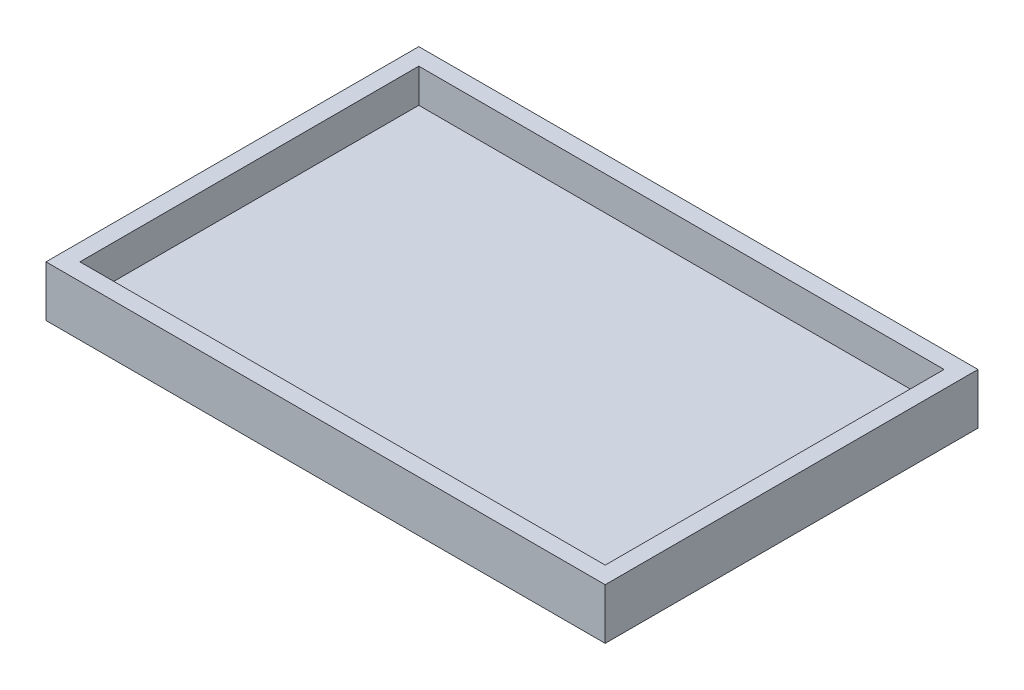
ISO-10303-21;
HEADER;
FILE_DESCRIPTION(('STEP AP214'),'2;1');
FILE_NAME('part.step','',(''),(''),'','','');
FILE_SCHEMA(('AUTOMOTIVE_DESIGN { 1 0 10303 214 1 1 1 1 }'));
ENDSEC;
DATA;
#1=APPLICATION_CONTEXT('core data for automotive mechanical design processes');
#2=APPLICATION_PROTOCOL_DEFINITION('international standard','automotive_design',2000,#1);
#3=PRODUCT_CONTEXT('',#1,'mechanical');
#4=PRODUCT('Part','Part','',(#3));
#5=PRODUCT_RELATED_PRODUCT_CATEGORY('part','',(#4));
#6=PRODUCT_DEFINITION_FORMATION('','',#4);
#7=PRODUCT_DEFINITION_CONTEXT('part definition',#1,'design');
#8=PRODUCT_DEFINITION('design','',#6,#7);
#9=PRODUCT_DEFINITION_SHAPE('','',#8);
#10=(LENGTH_UNIT() NAMED_UNIT(*) SI_UNIT(.MILLI.,.METRE.));
#11=(NAMED_UNIT(*) PLANE_ANGLE_UNIT() SI_UNIT($,.RADIAN.));
#12=(NAMED_UNIT(*) SI_UNIT($,.STERADIAN.) SOLID_ANGLE_UNIT());
#13=UNCERTAINTY_MEASURE_WITH_UNIT(LENGTH_MEASURE(1.E-05),#10,'distance_accuracy_value','');
#14=(GEOMETRIC_REPRESENTATION_CONTEXT(3) GLOBAL_UNCERTAINTY_ASSIGNED_CONTEXT((#13)) GLOBAL_UNIT_ASSIGNED_CONTEXT((#10,
#11,#12)) REPRESENTATION_CONTEXT('',''));
#15=CARTESIAN_POINT('',(0.,0.,0.));
#16=DIRECTION('',(0.,0.,1.));
#17=DIRECTION('',(1.,0.,0.));
#18=AXIS2_PLACEMENT_3D('',#15,#16,#17);
#19=CARTESIAN_POINT('',(0.,6.,-44.));
#20=DIRECTION('',(1.,0.,0.));
#21=DIRECTION('',(0.,0.,-1.));
#22=AXIS2_PLACEMENT_3D('',#19,#20,#21);
#23=PLANE('',#22);
#24=DIRECTION('',(0.,0.,1.));
#25=VECTOR('',#24,1.);
#26=CARTESIAN_POINT('',(0.,0.,-44.));
#27=LINE('',#26,#25);
#28=CARTESIAN_POINT('',(0.,0.,-44.));
#29=VERTEX_POINT('',#28);
#30=CARTESIAN_POINT('',(0.,0.,0.));
#31=VERTEX_POINT('',#30);
#32=EDGE_CURVE('E143',#29,#31,#27,.T.);
#33=ORIENTED_EDGE('',*,*,#32,.T.);
#34=DIRECTION('',(0.,-1.,0.));
#35=VECTOR('',#34,1.);
#36=CARTESIAN_POINT('',(0.,6.,0.));
#37=LINE('',#36,#35);
#38=CARTESIAN_POINT('',(0.,6.,0.));
#39=VERTEX_POINT('',#38);
#40=EDGE_CURVE('E11',#39,#31,#37,.T.);
#41=ORIENTED_EDGE('',*,*,#40,.F.);
#42=DIRECTION('',(0.,0.,1.));
#43=VECTOR('',#42,1.);
#44=CARTESIAN_POINT('',(0.,6.,-44.));
#45=LINE('',#44,#43);
#46=CARTESIAN_POINT('',(0.,6.,-44.));
#47=VERTEX_POINT('',#46);
#48=EDGE_CURVE('E147',#47,#39,#45,.T.);
#49=ORIENTED_EDGE('',*,*,#48,.F.);
#50=DIRECTION('',(0.,-1.,0.));
#51=VECTOR('',#50,1.);
#52=CARTESIAN_POINT('',(0.,6.,-44.));
#53=LINE('',#52,#51);
#54=EDGE_CURVE('E153',#47,#29,#53,.T.);
#55=ORIENTED_EDGE('',*,*,#54,.T.);
#56=EDGE_LOOP('',(#33,#41,#49,#55));
#57=FACE_BOUND('',#56,.T.);
#58=ADVANCED_FACE('F35',(#57),#23,.F.);
#59=CARTESIAN_POINT('',(0.,6.,0.));
#60=DIRECTION('',(0.,0.,-1.));
#61=DIRECTION('',(-1.,0.,0.));
#62=AXIS2_PLACEMENT_3D('',#59,#60,#61);
#63=PLANE('',#62);
#64=DIRECTION('',(1.,0.,0.));
#65=VECTOR('',#64,1.);
#66=CARTESIAN_POINT('',(0.,0.,0.));
#67=LINE('',#66,#65);
#68=CARTESIAN_POINT('',(66.,0.,0.));
#69=VERTEX_POINT('',#68);
#70=EDGE_CURVE('E156',#31,#69,#67,.T.);
#71=ORIENTED_EDGE('',*,*,#70,.T.);
#72=DIRECTION('',(0.,-1.,0.));
#73=VECTOR('',#72,1.);
#74=CARTESIAN_POINT('',(66.,6.,0.));
#75=LINE('',#74,#73);
#76=CARTESIAN_POINT('',(66.,6.,0.));
#77=VERTEX_POINT('',#76);
#78=EDGE_CURVE('E42',#77,#69,#75,.T.);
#79=ORIENTED_EDGE('',*,*,#78,.F.);
#80=DIRECTION('',(1.,0.,0.));
#81=VECTOR('',#80,1.);
#82=CARTESIAN_POINT('',(0.,6.,0.));
#83=LINE('',#82,#81);
#84=EDGE_CURVE('E86',#39,#77,#83,.T.);
#85=ORIENTED_EDGE('',*,*,#84,.F.);
#86=ORIENTED_EDGE('',*,*,#40,.T.);
#87=EDGE_LOOP('',(#71,#79,#85,#86));
#88=FACE_BOUND('',#87,.T.);
#89=ADVANCED_FACE('F185',(#88),#63,.F.);
#90=CARTESIAN_POINT('',(66.,6.,0.));
#91=DIRECTION('',(-1.,0.,0.));
#92=DIRECTION('',(0.,0.,1.));
#93=AXIS2_PLACEMENT_3D('',#90,#91,#92);
#94=PLANE('',#93);
#95=DIRECTION('',(0.,0.,-1.));
#96=VECTOR('',#95,1.);
#97=CARTESIAN_POINT('',(66.,0.,0.));
#98=LINE('',#97,#96);
#99=CARTESIAN_POINT('',(66.,0.,-44.));
#100=VERTEX_POINT('',#99);
#101=EDGE_CURVE('E158',#69,#100,#98,.T.);
#102=ORIENTED_EDGE('',*,*,#101,.T.);
#103=DIRECTION('',(0.,-1.,0.));
#104=VECTOR('',#103,1.);
#105=CARTESIAN_POINT('',(66.,6.,-44.));
#106=LINE('',#105,#104);
#107=CARTESIAN_POINT('',(66.,6.,-44.));
#108=VERTEX_POINT('',#107);
#109=EDGE_CURVE('E162',#108,#100,#106,.T.);
#110=ORIENTED_EDGE('',*,*,#109,.F.);
#111=DIRECTION('',(0.,0.,-1.));
#112=VECTOR('',#111,1.);
#113=CARTESIAN_POINT('',(66.,6.,0.));
#114=LINE('',#113,#112);
#115=EDGE_CURVE('E150',#77,#108,#114,.T.);
#116=ORIENTED_EDGE('',*,*,#115,.F.);
#117=ORIENTED_EDGE('',*,*,#78,.T.);
#118=EDGE_LOOP('',(#102,#110,#116,#117));
#119=FACE_BOUND('',#118,.T.);
#120=ADVANCED_FACE('F167',(#119),#94,.F.);
#121=CARTESIAN_POINT('',(66.,6.,-44.));
#122=DIRECTION('',(0.,0.,1.));
#123=DIRECTION('',(1.,0.,0.));
#124=AXIS2_PLACEMENT_3D('',#121,#122,#123);
#125=PLANE('',#124);
#126=DIRECTION('',(-1.,0.,0.));
#127=VECTOR('',#126,1.);
#128=CARTESIAN_POINT('',(66.,0.,-44.));
#129=LINE('',#128,#127);
#130=EDGE_CURVE('E79',#100,#29,#129,.T.);
#131=ORIENTED_EDGE('',*,*,#130,.T.);
#132=ORIENTED_EDGE('',*,*,#54,.F.);
#133=DIRECTION('',(-1.,0.,0.));
#134=VECTOR('',#133,1.);
#135=CARTESIAN_POINT('',(66.,6.,-44.));
#136=LINE('',#135,#134);
#137=EDGE_CURVE('E58',#108,#47,#136,.T.);
#138=ORIENTED_EDGE('',*,*,#137,.F.);
#139=ORIENTED_EDGE('',*,*,#109,.T.);
#140=EDGE_LOOP('',(#131,#132,#138,#139));
#141=FACE_BOUND('',#140,.T.);
#142=ADVANCED_FACE('F175',(#141),#125,.F.);
#143=CARTESIAN_POINT('',(0.,6.,0.));
#144=DIRECTION('',(0.,1.,0.));
#145=DIRECTION('',(0.,0.,1.));
#146=AXIS2_PLACEMENT_3D('',#143,#144,#145);
#147=PLANE('',#146);
#148=DIRECTION('',(0.,0.,1.));
#149=VECTOR('',#148,1.);
#150=CARTESIAN_POINT('',(2.,6.,-2.));
#151=LINE('',#150,#149);
#152=CARTESIAN_POINT('',(2.,6.,-42.));
#153=VERTEX_POINT('',#152);
#154=CARTESIAN_POINT('',(2.,6.,-2.));
#155=VERTEX_POINT('',#154);
#156=EDGE_CURVE('E49',#153,#155,#151,.T.);
#157=ORIENTED_EDGE('',*,*,#156,.F.);
#158=DIRECTION('',(-1.,0.,0.));
#159=VECTOR('',#158,1.);
#160=CARTESIAN_POINT('',(2.,6.,-42.));
#161=LINE('',#160,#159);
#162=CARTESIAN_POINT('',(64.,6.,-42.));
#163=VERTEX_POINT('',#162);
#164=EDGE_CURVE('E128',#163,#153,#161,.T.);
#165=ORIENTED_EDGE('',*,*,#164,.F.);
#166=DIRECTION('',(0.,0.,-1.));
#167=VECTOR('',#166,1.);
#168=CARTESIAN_POINT('',(64.,6.,-2.));
#169=LINE('',#168,#167);
#170=CARTESIAN_POINT('',(64.,6.,-2.));
#171=VERTEX_POINT('',#170);
#172=EDGE_CURVE('E131',#171,#163,#169,.T.);
#173=ORIENTED_EDGE('',*,*,#172,.F.);
#174=DIRECTION('',(1.,0.,0.));
#175=VECTOR('',#174,1.);
#176=CARTESIAN_POINT('',(2.,6.,-2.));
#177=LINE('',#176,#175);
#178=EDGE_CURVE('E137',#155,#171,#177,.T.);
#179=ORIENTED_EDGE('',*,*,#178,.F.);
#180=EDGE_LOOP('',(#157,#165,#173,#179));
#181=FACE_BOUND('',#180,.T.);
#182=ORIENTED_EDGE('',*,*,#48,.T.);
#183=ORIENTED_EDGE('',*,*,#84,.T.);
#184=ORIENTED_EDGE('',*,*,#115,.T.);
#185=ORIENTED_EDGE('',*,*,#137,.T.);
#186=EDGE_LOOP('',(#182,#183,#184,#185));
#187=FACE_BOUND('',#186,.T.);
#188=ADVANCED_FACE('F177',(#181,#187),#147,.T.);
#189=CARTESIAN_POINT('',(0.,0.,0.));
#190=DIRECTION('',(0.,1.,0.));
#191=DIRECTION('',(0.,0.,1.));
#192=AXIS2_PLACEMENT_3D('',#189,#190,#191);
#193=PLANE('',#192);
#194=ORIENTED_EDGE('',*,*,#32,.F.);
#195=ORIENTED_EDGE('',*,*,#130,.F.);
#196=ORIENTED_EDGE('',*,*,#101,.F.);
#197=ORIENTED_EDGE('',*,*,#70,.F.);
#198=EDGE_LOOP('',(#194,#195,#196,#197));
#199=FACE_BOUND('',#198,.T.);
#200=ADVANCED_FACE('F171',(#199),#193,.F.);
#201=CARTESIAN_POINT('',(2.,2.,-2.));
#202=DIRECTION('',(-1.,0.,0.));
#203=DIRECTION('',(0.,0.,1.));
#204=AXIS2_PLACEMENT_3D('',#201,#202,#203);
#205=PLANE('',#204);
#206=ORIENTED_EDGE('',*,*,#156,.T.);
#207=DIRECTION('',(0.,1.,0.));
#208=VECTOR('',#207,1.);
#209=CARTESIAN_POINT('',(2.,2.,-2.));
#210=LINE('',#209,#208);
#211=CARTESIAN_POINT('',(2.,2.,-2.));
#212=VERTEX_POINT('',#211);
#213=EDGE_CURVE('E106',#212,#155,#210,.T.);
#214=ORIENTED_EDGE('',*,*,#213,.F.);
#215=DIRECTION('',(0.,0.,1.));
#216=VECTOR('',#215,1.);
#217=CARTESIAN_POINT('',(2.,2.,-2.));
#218=LINE('',#217,#216);
#219=CARTESIAN_POINT('',(2.,2.,-42.));
#220=VERTEX_POINT('',#219);
#221=EDGE_CURVE('E110',#220,#212,#218,.T.);
#222=ORIENTED_EDGE('',*,*,#221,.F.);
#223=DIRECTION('',(0.,1.,0.));
#224=VECTOR('',#223,1.);
#225=CARTESIAN_POINT('',(2.,2.,-42.));
#226=LINE('',#225,#224);
#227=EDGE_CURVE('E141',#220,#153,#226,.T.);
#228=ORIENTED_EDGE('',*,*,#227,.T.);
#229=EDGE_LOOP('',(#206,#214,#222,#228));
#230=FACE_BOUND('',#229,.T.);
#231=ADVANCED_FACE('F108',(#230),#205,.F.);
#232=CARTESIAN_POINT('',(2.,2.,-42.));
#233=DIRECTION('',(0.,0.,-1.));
#234=DIRECTION('',(-1.,0.,0.));
#235=AXIS2_PLACEMENT_3D('',#232,#233,#234);
#236=PLANE('',#235);
#237=ORIENTED_EDGE('',*,*,#164,.T.);
#238=ORIENTED_EDGE('',*,*,#227,.F.);
#239=DIRECTION('',(-1.,0.,0.));
#240=VECTOR('',#239,1.);
#241=CARTESIAN_POINT('',(2.,2.,-42.));
#242=LINE('',#241,#240);
#243=CARTESIAN_POINT('',(64.,2.,-42.));
#244=VERTEX_POINT('',#243);
#245=EDGE_CURVE('E116',#244,#220,#242,.T.);
#246=ORIENTED_EDGE('',*,*,#245,.F.);
#247=DIRECTION('',(0.,1.,0.));
#248=VECTOR('',#247,1.);
#249=CARTESIAN_POINT('',(64.,2.,-42.));
#250=LINE('',#249,#248);
#251=EDGE_CURVE('E144',#244,#163,#250,.T.);
#252=ORIENTED_EDGE('',*,*,#251,.T.);
#253=EDGE_LOOP('',(#237,#238,#246,#252));
#254=FACE_BOUND('',#253,.T.);
#255=ADVANCED_FACE('F224',(#254),#236,.F.);
#256=CARTESIAN_POINT('',(64.,2.,-2.));
#257=DIRECTION('',(1.,0.,0.));
#258=DIRECTION('',(0.,0.,-1.));
#259=AXIS2_PLACEMENT_3D('',#256,#257,#258);
#260=PLANE('',#259);
#261=ORIENTED_EDGE('',*,*,#172,.T.);
#262=ORIENTED_EDGE('',*,*,#251,.F.);
#263=DIRECTION('',(0.,0.,-1.));
#264=VECTOR('',#263,1.);
#265=CARTESIAN_POINT('',(64.,2.,-2.));
#266=LINE('',#265,#264);
#267=CARTESIAN_POINT('',(64.,2.,-2.));
#268=VERTEX_POINT('',#267);
#269=EDGE_CURVE('E124',#268,#244,#266,.T.);
#270=ORIENTED_EDGE('',*,*,#269,.F.);
#271=DIRECTION('',(0.,1.,0.));
#272=VECTOR('',#271,1.);
#273=CARTESIAN_POINT('',(64.,2.,-2.));
#274=LINE('',#273,#272);
#275=EDGE_CURVE('E115',#268,#171,#274,.T.);
#276=ORIENTED_EDGE('',*,*,#275,.T.);
#277=EDGE_LOOP('',(#261,#262,#270,#276));
#278=FACE_BOUND('',#277,.T.);
#279=ADVANCED_FACE('F233',(#278),#260,.F.);
#280=CARTESIAN_POINT('',(2.,2.,-2.));
#281=DIRECTION('',(0.,0.,1.));
#282=DIRECTION('',(1.,0.,0.));
#283=AXIS2_PLACEMENT_3D('',#280,#281,#282);
#284=PLANE('',#283);
#285=ORIENTED_EDGE('',*,*,#178,.T.);
#286=ORIENTED_EDGE('',*,*,#275,.F.);
#287=DIRECTION('',(1.,0.,0.));
#288=VECTOR('',#287,1.);
#289=CARTESIAN_POINT('',(2.,2.,-2.));
#290=LINE('',#289,#288);
#291=EDGE_CURVE('E119',#212,#268,#290,.T.);
#292=ORIENTED_EDGE('',*,*,#291,.F.);
#293=ORIENTED_EDGE('',*,*,#213,.T.);
#294=EDGE_LOOP('',(#285,#286,#292,#293));
#295=FACE_BOUND('',#294,.T.);
#296=ADVANCED_FACE('F120',(#295),#284,.F.);
#297=CARTESIAN_POINT('',(0.,2.,0.));
#298=DIRECTION('',(0.,-1.,0.));
#299=DIRECTION('',(0.,0.,-1.));
#300=AXIS2_PLACEMENT_3D('',#297,#298,#299);
#301=PLANE('',#300);
#302=ORIENTED_EDGE('',*,*,#221,.T.);
#303=ORIENTED_EDGE('',*,*,#291,.T.);
#304=ORIENTED_EDGE('',*,*,#269,.T.);
#305=ORIENTED_EDGE('',*,*,#245,.T.);
#306=EDGE_LOOP('',(#302,#303,#304,#305));
#307=FACE_BOUND('',#306,.T.);
#308=ADVANCED_FACE('F126',(#307),#301,.F.);
#309=CLOSED_SHELL('',(#58,#89,#120,#142,#188,#200,#231,#255,#279,#296,#308));
#310=MANIFOLD_SOLID_BREP('B2',#309);
#311=ADVANCED_BREP_SHAPE_REPRESENTATION('',(#18,#310),#14);
#312=SHAPE_DEFINITION_REPRESENTATION(#9,#311);
ENDSEC;
END-ISO-10303-21;
